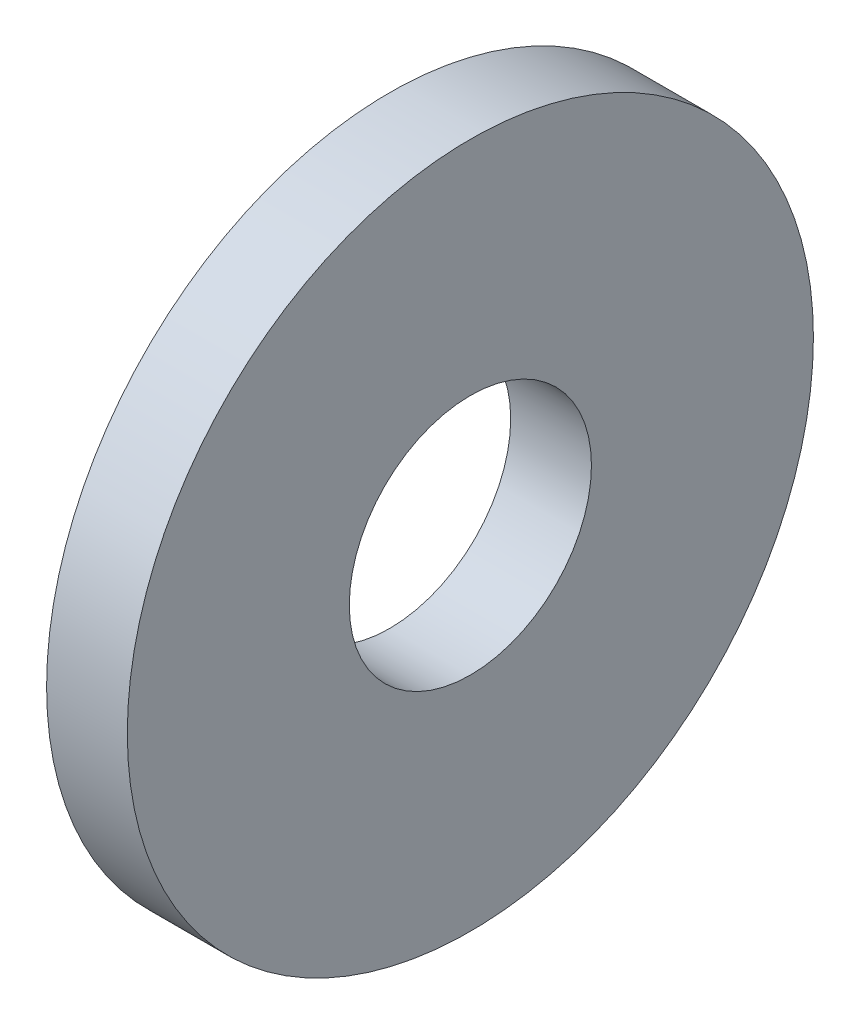
ISO-10303-21;
HEADER;
FILE_DESCRIPTION(('STEP AP214'),'2;1');
FILE_NAME('part.step','',(''),(''),'','','');
FILE_SCHEMA(('AUTOMOTIVE_DESIGN { 1 0 10303 214 1 1 1 1 }'));
ENDSEC;
DATA;
#1=APPLICATION_CONTEXT('core data for automotive mechanical design processes');
#2=APPLICATION_PROTOCOL_DEFINITION('international standard','automotive_design',2000,#1);
#3=PRODUCT_CONTEXT('',#1,'mechanical');
#4=PRODUCT('Part','Part','',(#3));
#5=PRODUCT_RELATED_PRODUCT_CATEGORY('part','',(#4));
#6=PRODUCT_DEFINITION_FORMATION('','',#4);
#7=PRODUCT_DEFINITION_CONTEXT('part definition',#1,'design');
#8=PRODUCT_DEFINITION('design','',#6,#7);
#9=PRODUCT_DEFINITION_SHAPE('','',#8);
#10=(LENGTH_UNIT() NAMED_UNIT(*) SI_UNIT(.MILLI.,.METRE.));
#11=(NAMED_UNIT(*) PLANE_ANGLE_UNIT() SI_UNIT($,.RADIAN.));
#12=(NAMED_UNIT(*) SI_UNIT($,.STERADIAN.) SOLID_ANGLE_UNIT());
#13=UNCERTAINTY_MEASURE_WITH_UNIT(LENGTH_MEASURE(1.E-05),#10,'distance_accuracy_value','');
#14=(GEOMETRIC_REPRESENTATION_CONTEXT(3) GLOBAL_UNCERTAINTY_ASSIGNED_CONTEXT((#13)) GLOBAL_UNIT_ASSIGNED_CONTEXT((#10,
#11,#12)) REPRESENTATION_CONTEXT('',''));
#15=CARTESIAN_POINT('',(0.,0.,0.));
#16=DIRECTION('',(0.,0.,1.));
#17=DIRECTION('',(1.,0.,0.));
#18=AXIS2_PLACEMENT_3D('',#15,#16,#17);
#19=CARTESIAN_POINT('',(2.,0.,0.));
#20=DIRECTION('',(-1.,0.,0.));
#21=DIRECTION('',(0.,0.,1.));
#22=AXIS2_PLACEMENT_3D('',#19,#20,#21);
#23=CYLINDRICAL_SURFACE('',#22,17.);
#24=CARTESIAN_POINT('',(2.,0.,0.));
#25=DIRECTION('',(1.,0.,0.));
#26=DIRECTION('',(0.,0.,-1.));
#27=AXIS2_PLACEMENT_3D('',#24,#25,#26);
#28=CIRCLE('',#27,17.);
#29=CARTESIAN_POINT('',(2.,0.,-17.));
#30=VERTEX_POINT('',#29);
#31=EDGE_CURVE('E10',#30,#30,#28,.T.);
#32=ORIENTED_EDGE('',*,*,#31,.F.);
#33=EDGE_LOOP('',(#32));
#34=FACE_BOUND('',#33,.T.);
#35=CARTESIAN_POINT('',(-2.,0.,0.));
#36=DIRECTION('',(1.,0.,0.));
#37=DIRECTION('',(0.,0.,-1.));
#38=AXIS2_PLACEMENT_3D('',#35,#36,#37);
#39=CIRCLE('',#38,17.);
#40=CARTESIAN_POINT('',(-2.,0.,-17.));
#41=VERTEX_POINT('',#40);
#42=EDGE_CURVE('E34',#41,#41,#39,.T.);
#43=ORIENTED_EDGE('',*,*,#42,.T.);
#44=EDGE_LOOP('',(#43));
#45=FACE_BOUND('',#44,.T.);
#46=ADVANCED_FACE('F31',(#34,#45),#23,.T.);
#47=CARTESIAN_POINT('',(2.,0.,0.));
#48=DIRECTION('',(1.,0.,0.));
#49=DIRECTION('',(0.,0.,-1.));
#50=AXIS2_PLACEMENT_3D('',#47,#48,#49);
#51=PLANE('',#50);
#52=CARTESIAN_POINT('',(2.,0.,0.));
#53=DIRECTION('',(1.,0.,0.));
#54=DIRECTION('',(0.,0.,-1.));
#55=AXIS2_PLACEMENT_3D('',#52,#53,#54);
#56=CIRCLE('',#55,6.);
#57=CARTESIAN_POINT('',(2.,0.,-6.));
#58=VERTEX_POINT('',#57);
#59=EDGE_CURVE('E45',#58,#58,#56,.T.);
#60=ORIENTED_EDGE('',*,*,#59,.F.);
#61=EDGE_LOOP('',(#60));
#62=FACE_BOUND('',#61,.T.);
#63=ORIENTED_EDGE('',*,*,#31,.T.);
#64=EDGE_LOOP('',(#63));
#65=FACE_BOUND('',#64,.T.);
#66=ADVANCED_FACE('F51',(#62,#65),#51,.T.);
#67=CARTESIAN_POINT('',(-2.,0.,0.));
#68=DIRECTION('',(1.,0.,0.));
#69=DIRECTION('',(0.,0.,-1.));
#70=AXIS2_PLACEMENT_3D('',#67,#68,#69);
#71=PLANE('',#70);
#72=CARTESIAN_POINT('',(-2.,0.,0.));
#73=DIRECTION('',(1.,0.,0.));
#74=DIRECTION('',(0.,0.,-1.));
#75=AXIS2_PLACEMENT_3D('',#72,#73,#74);
#76=CIRCLE('',#75,6.);
#77=CARTESIAN_POINT('',(-2.,0.,-6.));
#78=VERTEX_POINT('',#77);
#79=EDGE_CURVE('E41',#78,#78,#76,.T.);
#80=ORIENTED_EDGE('',*,*,#79,.T.);
#81=EDGE_LOOP('',(#80));
#82=FACE_BOUND('',#81,.T.);
#83=ORIENTED_EDGE('',*,*,#42,.F.);
#84=EDGE_LOOP('',(#83));
#85=FACE_BOUND('',#84,.T.);
#86=ADVANCED_FACE('F53',(#82,#85),#71,.F.);
#87=CARTESIAN_POINT('',(-2.,0.,0.));
#88=DIRECTION('',(1.,0.,0.));
#89=DIRECTION('',(0.,0.,-1.));
#90=AXIS2_PLACEMENT_3D('',#87,#88,#89);
#91=CYLINDRICAL_SURFACE('',#90,6.);
#92=ORIENTED_EDGE('',*,*,#79,.F.);
#93=EDGE_LOOP('',(#92));
#94=FACE_BOUND('',#93,.T.);
#95=ORIENTED_EDGE('',*,*,#59,.T.);
#96=EDGE_LOOP('',(#95));
#97=FACE_BOUND('',#96,.T.);
#98=ADVANCED_FACE('F49',(#94,#97),#91,.F.);
#99=CLOSED_SHELL('',(#46,#66,#86,#98));
#100=MANIFOLD_SOLID_BREP('B2',#99);
#101=ADVANCED_BREP_SHAPE_REPRESENTATION('',(#18,#100),#14);
#102=SHAPE_DEFINITION_REPRESENTATION(#9,#101);
ENDSEC;
END-ISO-10303-21;
